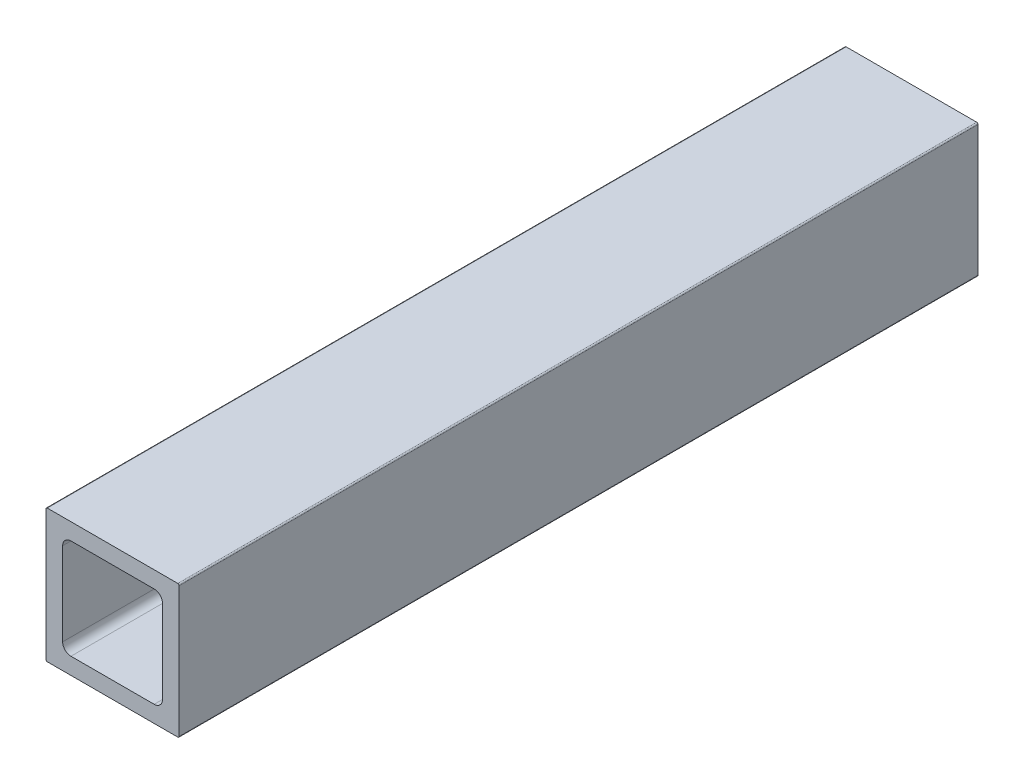
ISO-10303-21;
HEADER;
FILE_DESCRIPTION(('STEP AP214'),'2;1');
FILE_NAME('part.step','',(''),(''),'','','');
FILE_SCHEMA(('AUTOMOTIVE_DESIGN { 1 0 10303 214 1 1 1 1 }'));
ENDSEC;
DATA;
#1=APPLICATION_CONTEXT('core data for automotive mechanical design processes');
#2=APPLICATION_PROTOCOL_DEFINITION('international standard','automotive_design',2000,#1);
#3=PRODUCT_CONTEXT('',#1,'mechanical');
#4=PRODUCT('Part','Part','',(#3));
#5=PRODUCT_RELATED_PRODUCT_CATEGORY('part','',(#4));
#6=PRODUCT_DEFINITION_FORMATION('','',#4);
#7=PRODUCT_DEFINITION_CONTEXT('part definition',#1,'design');
#8=PRODUCT_DEFINITION('design','',#6,#7);
#9=PRODUCT_DEFINITION_SHAPE('','',#8);
#10=(LENGTH_UNIT() NAMED_UNIT(*) SI_UNIT(.MILLI.,.METRE.));
#11=(NAMED_UNIT(*) PLANE_ANGLE_UNIT() SI_UNIT($,.RADIAN.));
#12=(NAMED_UNIT(*) SI_UNIT($,.STERADIAN.) SOLID_ANGLE_UNIT());
#13=UNCERTAINTY_MEASURE_WITH_UNIT(LENGTH_MEASURE(1.E-05),#10,'distance_accuracy_value','');
#14=(GEOMETRIC_REPRESENTATION_CONTEXT(3) GLOBAL_UNCERTAINTY_ASSIGNED_CONTEXT((#13)) GLOBAL_UNIT_ASSIGNED_CONTEXT((#10,
#11,#12)) REPRESENTATION_CONTEXT('',''));
#15=CARTESIAN_POINT('',(0.,0.,0.));
#16=DIRECTION('',(0.,0.,1.));
#17=DIRECTION('',(1.,0.,0.));
#18=AXIS2_PLACEMENT_3D('',#15,#16,#17);
#19=CARTESIAN_POINT('',(3.175,4.7625,1828.8));
#20=DIRECTION('',(1.,0.,0.));
#21=DIRECTION('',(0.,1.,0.));
#22=AXIS2_PLACEMENT_3D('',#19,#20,#21);
#23=PLANE('',#22);
#24=DIRECTION('',(0.,-1.,0.));
#25=VECTOR('',#24,1.);
#26=CARTESIAN_POINT('',(3.175,4.7625,1676.4));
#27=LINE('',#26,#25);
#28=CARTESIAN_POINT('',(3.175,20.6375,1676.4));
#29=VERTEX_POINT('',#28);
#30=CARTESIAN_POINT('',(3.175,4.7625,1676.4));
#31=VERTEX_POINT('',#30);
#32=EDGE_CURVE('E60',#29,#31,#27,.T.);
#33=ORIENTED_EDGE('',*,*,#32,.F.);
#34=DIRECTION('',(0.,0.,-1.));
#35=VECTOR('',#34,1.);
#36=CARTESIAN_POINT('',(3.175,20.6375,1828.8));
#37=LINE('',#36,#35);
#38=CARTESIAN_POINT('',(3.175,20.6375,1828.8));
#39=VERTEX_POINT('',#38);
#40=EDGE_CURVE('E53',#39,#29,#37,.T.);
#41=ORIENTED_EDGE('',*,*,#40,.F.);
#42=DIRECTION('',(0.,-1.,0.));
#43=VECTOR('',#42,1.);
#44=CARTESIAN_POINT('',(3.175,4.7625,1828.8));
#45=LINE('',#44,#43);
#46=CARTESIAN_POINT('',(3.175,4.7625,1828.8));
#47=VERTEX_POINT('',#46);
#48=EDGE_CURVE('E219',#39,#47,#45,.T.);
#49=ORIENTED_EDGE('',*,*,#48,.T.);
#50=DIRECTION('',(0.,0.,-1.));
#51=VECTOR('',#50,1.);
#52=CARTESIAN_POINT('',(3.175,4.7625,1828.8));
#53=LINE('',#52,#51);
#54=EDGE_CURVE('E325',#47,#31,#53,.T.);
#55=ORIENTED_EDGE('',*,*,#54,.T.);
#56=EDGE_LOOP('',(#33,#41,#49,#55));
#57=FACE_BOUND('',#56,.T.);
#58=ADVANCED_FACE('F45',(#57),#23,.T.);
#59=CARTESIAN_POINT('',(4.7625,20.6375,1828.8));
#60=DIRECTION('',(0.,0.,-1.));
#61=DIRECTION('',(-1.,0.,0.));
#62=AXIS2_PLACEMENT_3D('',#59,#60,#61);
#63=CYLINDRICAL_SURFACE('',#62,1.5875);
#64=ORIENTED_EDGE('',*,*,#40,.T.);
#65=CARTESIAN_POINT('',(4.7625,20.6375,1676.4));
#66=DIRECTION('',(0.,0.,1.));
#67=DIRECTION('',(1.,0.,0.));
#68=AXIS2_PLACEMENT_3D('',#65,#66,#67);
#69=CIRCLE('',#68,1.5875);
#70=CARTESIAN_POINT('',(4.7625,22.225,1676.4));
#71=VERTEX_POINT('',#70);
#72=EDGE_CURVE('E304',#29,#71,#69,.F.);
#73=ORIENTED_EDGE('',*,*,#72,.T.);
#74=DIRECTION('',(0.,0.,-1.));
#75=VECTOR('',#74,1.);
#76=CARTESIAN_POINT('',(4.7625,22.225,1828.8));
#77=LINE('',#76,#75);
#78=CARTESIAN_POINT('',(4.7625,22.225,1828.8));
#79=VERTEX_POINT('',#78);
#80=EDGE_CURVE('E292',#79,#71,#77,.T.);
#81=ORIENTED_EDGE('',*,*,#80,.F.);
#82=CARTESIAN_POINT('',(4.7625,20.6375,1828.8));
#83=DIRECTION('',(0.,0.,1.));
#84=DIRECTION('',(-1.,0.,0.));
#85=AXIS2_PLACEMENT_3D('',#82,#83,#84);
#86=CIRCLE('',#85,1.5875);
#87=EDGE_CURVE('E224',#79,#39,#86,.T.);
#88=ORIENTED_EDGE('',*,*,#87,.T.);
#89=EDGE_LOOP('',(#64,#73,#81,#88));
#90=FACE_BOUND('',#89,.T.);
#91=ADVANCED_FACE('F302',(#90),#63,.F.);
#92=CARTESIAN_POINT('',(4.7625,22.225,1828.8));
#93=DIRECTION('',(0.,-1.,0.));
#94=DIRECTION('',(0.,0.,-1.));
#95=AXIS2_PLACEMENT_3D('',#92,#93,#94);
#96=PLANE('',#95);
#97=DIRECTION('',(-1.,0.,0.));
#98=VECTOR('',#97,1.);
#99=CARTESIAN_POINT('',(4.7625,22.225,1676.4));
#100=LINE('',#99,#98);
#101=CARTESIAN_POINT('',(20.6375,22.225,1676.4));
#102=VERTEX_POINT('',#101);
#103=EDGE_CURVE('E340',#102,#71,#100,.T.);
#104=ORIENTED_EDGE('',*,*,#103,.F.);
#105=DIRECTION('',(0.,0.,-1.));
#106=VECTOR('',#105,1.);
#107=CARTESIAN_POINT('',(20.6375,22.225,1828.8));
#108=LINE('',#107,#106);
#109=CARTESIAN_POINT('',(20.6375,22.225,1828.8));
#110=VERTEX_POINT('',#109);
#111=EDGE_CURVE('E239',#110,#102,#108,.T.);
#112=ORIENTED_EDGE('',*,*,#111,.F.);
#113=DIRECTION('',(-1.,0.,0.));
#114=VECTOR('',#113,1.);
#115=CARTESIAN_POINT('',(4.7625,22.225,1828.8));
#116=LINE('',#115,#114);
#117=EDGE_CURVE('E228',#110,#79,#116,.T.);
#118=ORIENTED_EDGE('',*,*,#117,.T.);
#119=ORIENTED_EDGE('',*,*,#80,.T.);
#120=EDGE_LOOP('',(#104,#112,#118,#119));
#121=FACE_BOUND('',#120,.T.);
#122=ADVANCED_FACE('F291',(#121),#96,.T.);
#123=CARTESIAN_POINT('',(20.6375,20.6375,1828.8));
#124=DIRECTION('',(0.,0.,-1.));
#125=DIRECTION('',(-1.,0.,0.));
#126=AXIS2_PLACEMENT_3D('',#123,#124,#125);
#127=CYLINDRICAL_SURFACE('',#126,1.5875);
#128=ORIENTED_EDGE('',*,*,#111,.T.);
#129=CARTESIAN_POINT('',(20.6375,20.6375,1676.4));
#130=DIRECTION('',(0.,0.,1.));
#131=DIRECTION('',(1.,0.,0.));
#132=AXIS2_PLACEMENT_3D('',#129,#130,#131);
#133=CIRCLE('',#132,1.5875);
#134=CARTESIAN_POINT('',(22.225,20.6375,1676.4));
#135=VERTEX_POINT('',#134);
#136=EDGE_CURVE('E342',#102,#135,#133,.F.);
#137=ORIENTED_EDGE('',*,*,#136,.T.);
#138=DIRECTION('',(0.,0.,-1.));
#139=VECTOR('',#138,1.);
#140=CARTESIAN_POINT('',(22.225,20.6375,1828.8));
#141=LINE('',#140,#139);
#142=CARTESIAN_POINT('',(22.225,20.6375,1828.8));
#143=VERTEX_POINT('',#142);
#144=EDGE_CURVE('E235',#143,#135,#141,.T.);
#145=ORIENTED_EDGE('',*,*,#144,.F.);
#146=CARTESIAN_POINT('',(20.6375,20.6375,1828.8));
#147=DIRECTION('',(0.,0.,1.));
#148=DIRECTION('',(-1.,0.,0.));
#149=AXIS2_PLACEMENT_3D('',#146,#147,#148);
#150=CIRCLE('',#149,1.5875);
#151=EDGE_CURVE('E214',#143,#110,#150,.T.);
#152=ORIENTED_EDGE('',*,*,#151,.T.);
#153=EDGE_LOOP('',(#128,#137,#145,#152));
#154=FACE_BOUND('',#153,.T.);
#155=ADVANCED_FACE('F527',(#154),#127,.F.);
#156=CARTESIAN_POINT('',(22.225,4.7625,1828.8));
#157=DIRECTION('',(-1.,0.,0.));
#158=DIRECTION('',(0.,0.,1.));
#159=AXIS2_PLACEMENT_3D('',#156,#157,#158);
#160=PLANE('',#159);
#161=DIRECTION('',(0.,1.,0.));
#162=VECTOR('',#161,1.);
#163=CARTESIAN_POINT('',(22.225,4.7625,1676.4));
#164=LINE('',#163,#162);
#165=CARTESIAN_POINT('',(22.225,4.7625,1676.4));
#166=VERTEX_POINT('',#165);
#167=EDGE_CURVE('E345',#166,#135,#164,.T.);
#168=ORIENTED_EDGE('',*,*,#167,.F.);
#169=DIRECTION('',(0.,0.,-1.));
#170=VECTOR('',#169,1.);
#171=CARTESIAN_POINT('',(22.225,4.7625,1828.8));
#172=LINE('',#171,#170);
#173=CARTESIAN_POINT('',(22.225,4.7625,1828.8));
#174=VERTEX_POINT('',#173);
#175=EDGE_CURVE('E240',#174,#166,#172,.T.);
#176=ORIENTED_EDGE('',*,*,#175,.F.);
#177=DIRECTION('',(0.,1.,0.));
#178=VECTOR('',#177,1.);
#179=CARTESIAN_POINT('',(22.225,4.7625,1828.8));
#180=LINE('',#179,#178);
#181=EDGE_CURVE('E209',#174,#143,#180,.T.);
#182=ORIENTED_EDGE('',*,*,#181,.T.);
#183=ORIENTED_EDGE('',*,*,#144,.T.);
#184=EDGE_LOOP('',(#168,#176,#182,#183));
#185=FACE_BOUND('',#184,.T.);
#186=ADVANCED_FACE('F397',(#185),#160,.T.);
#187=CARTESIAN_POINT('',(20.6375,4.7625,1828.8));
#188=DIRECTION('',(0.,0.,-1.));
#189=DIRECTION('',(-1.,0.,0.));
#190=AXIS2_PLACEMENT_3D('',#187,#188,#189);
#191=CYLINDRICAL_SURFACE('',#190,1.5875);
#192=ORIENTED_EDGE('',*,*,#175,.T.);
#193=CARTESIAN_POINT('',(20.6375,4.7625,1676.4));
#194=DIRECTION('',(0.,0.,1.));
#195=DIRECTION('',(1.,0.,0.));
#196=AXIS2_PLACEMENT_3D('',#193,#194,#195);
#197=CIRCLE('',#196,1.5875);
#198=CARTESIAN_POINT('',(20.6375,3.175,1676.4));
#199=VERTEX_POINT('',#198);
#200=EDGE_CURVE('E347',#166,#199,#197,.F.);
#201=ORIENTED_EDGE('',*,*,#200,.T.);
#202=DIRECTION('',(0.,0.,-1.));
#203=VECTOR('',#202,1.);
#204=CARTESIAN_POINT('',(20.6375,3.175,1828.8));
#205=LINE('',#204,#203);
#206=CARTESIAN_POINT('',(20.6375,3.175,1828.8));
#207=VERTEX_POINT('',#206);
#208=EDGE_CURVE('E266',#207,#199,#205,.T.);
#209=ORIENTED_EDGE('',*,*,#208,.F.);
#210=CARTESIAN_POINT('',(20.6375,4.7625,1828.8));
#211=DIRECTION('',(0.,0.,1.));
#212=DIRECTION('',(-1.,0.,0.));
#213=AXIS2_PLACEMENT_3D('',#210,#211,#212);
#214=CIRCLE('',#213,1.5875);
#215=EDGE_CURVE('E213',#207,#174,#214,.T.);
#216=ORIENTED_EDGE('',*,*,#215,.T.);
#217=EDGE_LOOP('',(#192,#201,#209,#216));
#218=FACE_BOUND('',#217,.T.);
#219=ADVANCED_FACE('F394',(#218),#191,.F.);
#220=CARTESIAN_POINT('',(4.7625,3.175,1828.8));
#221=DIRECTION('',(0.,1.,0.));
#222=DIRECTION('',(1.,0.,0.));
#223=AXIS2_PLACEMENT_3D('',#220,#221,#222);
#224=PLANE('',#223);
#225=DIRECTION('',(1.,0.,0.));
#226=VECTOR('',#225,1.);
#227=CARTESIAN_POINT('',(4.7625,3.175,1676.4));
#228=LINE('',#227,#226);
#229=CARTESIAN_POINT('',(4.7625,3.175,1676.4));
#230=VERTEX_POINT('',#229);
#231=EDGE_CURVE('E350',#230,#199,#228,.T.);
#232=ORIENTED_EDGE('',*,*,#231,.F.);
#233=DIRECTION('',(0.,0.,-1.));
#234=VECTOR('',#233,1.);
#235=CARTESIAN_POINT('',(4.7625,3.175,1828.8));
#236=LINE('',#235,#234);
#237=CARTESIAN_POINT('',(4.7625,3.175,1828.8));
#238=VERTEX_POINT('',#237);
#239=EDGE_CURVE('E270',#238,#230,#236,.T.);
#240=ORIENTED_EDGE('',*,*,#239,.F.);
#241=DIRECTION('',(1.,0.,0.));
#242=VECTOR('',#241,1.);
#243=CARTESIAN_POINT('',(4.7625,3.175,1828.8));
#244=LINE('',#243,#242);
#245=EDGE_CURVE('E256',#238,#207,#244,.T.);
#246=ORIENTED_EDGE('',*,*,#245,.T.);
#247=ORIENTED_EDGE('',*,*,#208,.T.);
#248=EDGE_LOOP('',(#232,#240,#246,#247));
#249=FACE_BOUND('',#248,.T.);
#250=ADVANCED_FACE('F396',(#249),#224,.T.);
#251=CARTESIAN_POINT('',(4.7625,4.7625,1828.8));
#252=DIRECTION('',(0.,0.,-1.));
#253=DIRECTION('',(-1.,0.,0.));
#254=AXIS2_PLACEMENT_3D('',#251,#252,#253);
#255=CYLINDRICAL_SURFACE('',#254,1.5875);
#256=ORIENTED_EDGE('',*,*,#239,.T.);
#257=CARTESIAN_POINT('',(4.7625,4.7625,1676.4));
#258=DIRECTION('',(0.,0.,1.));
#259=DIRECTION('',(1.,0.,0.));
#260=AXIS2_PLACEMENT_3D('',#257,#258,#259);
#261=CIRCLE('',#260,1.5875);
#262=EDGE_CURVE('E352',#230,#31,#261,.F.);
#263=ORIENTED_EDGE('',*,*,#262,.T.);
#264=ORIENTED_EDGE('',*,*,#54,.F.);
#265=CARTESIAN_POINT('',(4.7625,4.7625,1828.8));
#266=DIRECTION('',(0.,0.,1.));
#267=DIRECTION('',(1.,0.,0.));
#268=AXIS2_PLACEMENT_3D('',#265,#266,#267);
#269=CIRCLE('',#268,1.5875);
#270=EDGE_CURVE('E215',#47,#238,#269,.T.);
#271=ORIENTED_EDGE('',*,*,#270,.T.);
#272=EDGE_LOOP('',(#256,#263,#264,#271));
#273=FACE_BOUND('',#272,.T.);
#274=ADVANCED_FACE('F510',(#273),#255,.F.);
#275=CARTESIAN_POINT('',(0.,0.254,1828.8));
#276=DIRECTION('',(1.,0.,0.));
#277=DIRECTION('',(0.,1.,0.));
#278=AXIS2_PLACEMENT_3D('',#275,#276,#277);
#279=PLANE('',#278);
#280=DIRECTION('',(0.,0.,-1.));
#281=VECTOR('',#280,1.);
#282=CARTESIAN_POINT('',(0.,25.146,1828.8));
#283=LINE('',#282,#281);
#284=CARTESIAN_POINT('',(0.,25.146,1828.8));
#285=VERTEX_POINT('',#284);
#286=CARTESIAN_POINT('',(0.,25.146,1676.4));
#287=VERTEX_POINT('',#286);
#288=EDGE_CURVE('E265',#285,#287,#283,.T.);
#289=ORIENTED_EDGE('',*,*,#288,.T.);
#290=DIRECTION('',(0.,-1.,0.));
#291=VECTOR('',#290,1.);
#292=CARTESIAN_POINT('',(0.,0.254,1676.4));
#293=LINE('',#292,#291);
#294=CARTESIAN_POINT('',(0.,0.254,1676.4));
#295=VERTEX_POINT('',#294);
#296=EDGE_CURVE('E187',#287,#295,#293,.T.);
#297=ORIENTED_EDGE('',*,*,#296,.T.);
#298=DIRECTION('',(0.,0.,-1.));
#299=VECTOR('',#298,1.);
#300=CARTESIAN_POINT('',(0.,0.254,1828.8));
#301=LINE('',#300,#299);
#302=CARTESIAN_POINT('',(0.,0.254,1828.8));
#303=VERTEX_POINT('',#302);
#304=EDGE_CURVE('E196',#303,#295,#301,.T.);
#305=ORIENTED_EDGE('',*,*,#304,.F.);
#306=DIRECTION('',(0.,-1.,0.));
#307=VECTOR('',#306,1.);
#308=CARTESIAN_POINT('',(0.,0.254,1828.8));
#309=LINE('',#308,#307);
#310=EDGE_CURVE('E220',#285,#303,#309,.T.);
#311=ORIENTED_EDGE('',*,*,#310,.F.);
#312=EDGE_LOOP('',(#289,#297,#305,#311));
#313=FACE_BOUND('',#312,.T.);
#314=ADVANCED_FACE('F504',(#313),#279,.F.);
#315=CARTESIAN_POINT('',(0.254,25.146,1828.8));
#316=DIRECTION('',(0.,0.,-1.));
#317=DIRECTION('',(-1.,0.,0.));
#318=AXIS2_PLACEMENT_3D('',#315,#316,#317);
#319=CYLINDRICAL_SURFACE('',#318,0.254);
#320=CARTESIAN_POINT('',(0.254,25.146,1676.4));
#321=DIRECTION('',(0.,0.,1.));
#322=DIRECTION('',(1.,0.,0.));
#323=AXIS2_PLACEMENT_3D('',#320,#321,#322);
#324=CIRCLE('',#323,0.254);
#325=CARTESIAN_POINT('',(0.254000000000004,25.4,1676.4));
#326=VERTEX_POINT('',#325);
#327=EDGE_CURVE('E178',#287,#326,#324,.F.);
#328=ORIENTED_EDGE('',*,*,#327,.F.);
#329=ORIENTED_EDGE('',*,*,#288,.F.);
#330=CARTESIAN_POINT('',(0.254,25.146,1828.8));
#331=DIRECTION('',(0.,0.,1.));
#332=DIRECTION('',(-1.,0.,0.));
#333=AXIS2_PLACEMENT_3D('',#330,#331,#332);
#334=CIRCLE('',#333,0.254);
#335=CARTESIAN_POINT('',(0.254,25.4,1828.8));
#336=VERTEX_POINT('',#335);
#337=EDGE_CURVE('E241',#336,#285,#334,.T.);
#338=ORIENTED_EDGE('',*,*,#337,.F.);
#339=DIRECTION('',(0.,0.,-1.));
#340=VECTOR('',#339,1.);
#341=CARTESIAN_POINT('',(0.254,25.4,1828.8));
#342=LINE('',#341,#340);
#343=EDGE_CURVE('E261',#336,#326,#342,.T.);
#344=ORIENTED_EDGE('',*,*,#343,.T.);
#345=EDGE_LOOP('',(#328,#329,#338,#344));
#346=FACE_BOUND('',#345,.T.);
#347=ADVANCED_FACE('F509',(#346),#319,.T.);
#348=CARTESIAN_POINT('',(0.254,25.4,1828.8));
#349=DIRECTION('',(0.,-1.,0.));
#350=DIRECTION('',(0.,0.,-1.));
#351=AXIS2_PLACEMENT_3D('',#348,#349,#350);
#352=PLANE('',#351);
#353=DIRECTION('',(0.,0.,-1.));
#354=VECTOR('',#353,1.);
#355=CARTESIAN_POINT('',(25.146,25.4,1828.8));
#356=LINE('',#355,#354);
#357=CARTESIAN_POINT('',(25.146,25.4,1828.8));
#358=VERTEX_POINT('',#357);
#359=CARTESIAN_POINT('',(25.146,25.4,1676.4));
#360=VERTEX_POINT('',#359);
#361=EDGE_CURVE('E257',#358,#360,#356,.T.);
#362=ORIENTED_EDGE('',*,*,#361,.T.);
#363=DIRECTION('',(1.,0.,0.));
#364=VECTOR('',#363,1.);
#365=CARTESIAN_POINT('',(-135.222379220066,25.4,1676.4));
#366=LINE('',#365,#364);
#367=EDGE_CURVE('E188',#326,#360,#366,.T.);
#368=ORIENTED_EDGE('',*,*,#367,.F.);
#369=ORIENTED_EDGE('',*,*,#343,.F.);
#370=DIRECTION('',(-1.,0.,0.));
#371=VECTOR('',#370,1.);
#372=CARTESIAN_POINT('',(0.254,25.4,1828.8));
#373=LINE('',#372,#371);
#374=EDGE_CURVE('E233',#358,#336,#373,.T.);
#375=ORIENTED_EDGE('',*,*,#374,.F.);
#376=EDGE_LOOP('',(#362,#368,#369,#375));
#377=FACE_BOUND('',#376,.T.);
#378=ADVANCED_FACE('F367',(#377),#352,.F.);
#379=CARTESIAN_POINT('',(25.146,25.146,1828.8));
#380=DIRECTION('',(0.,0.,-1.));
#381=DIRECTION('',(-1.,0.,0.));
#382=AXIS2_PLACEMENT_3D('',#379,#380,#381);
#383=CYLINDRICAL_SURFACE('',#382,0.254);
#384=CARTESIAN_POINT('',(25.146,25.146,1676.4));
#385=DIRECTION('',(0.,0.,1.));
#386=DIRECTION('',(1.,0.,0.));
#387=AXIS2_PLACEMENT_3D('',#384,#385,#386);
#388=CIRCLE('',#387,0.254);
#389=CARTESIAN_POINT('',(25.4,25.146,1676.4));
#390=VERTEX_POINT('',#389);
#391=EDGE_CURVE('E354',#360,#390,#388,.F.);
#392=ORIENTED_EDGE('',*,*,#391,.F.);
#393=ORIENTED_EDGE('',*,*,#361,.F.);
#394=CARTESIAN_POINT('',(25.146,25.146,1828.8));
#395=DIRECTION('',(0.,0.,1.));
#396=DIRECTION('',(-1.,0.,0.));
#397=AXIS2_PLACEMENT_3D('',#394,#395,#396);
#398=CIRCLE('',#397,0.254);
#399=CARTESIAN_POINT('',(25.4,25.146,1828.8));
#400=VERTEX_POINT('',#399);
#401=EDGE_CURVE('E229',#400,#358,#398,.T.);
#402=ORIENTED_EDGE('',*,*,#401,.F.);
#403=DIRECTION('',(0.,0.,-1.));
#404=VECTOR('',#403,1.);
#405=CARTESIAN_POINT('',(25.4,25.146,1828.8));
#406=LINE('',#405,#404);
#407=EDGE_CURVE('E202',#400,#390,#406,.T.);
#408=ORIENTED_EDGE('',*,*,#407,.T.);
#409=EDGE_LOOP('',(#392,#393,#402,#408));
#410=FACE_BOUND('',#409,.T.);
#411=ADVANCED_FACE('F47',(#410),#383,.T.);
#412=CARTESIAN_POINT('',(25.4,0.254,1828.8));
#413=DIRECTION('',(-1.,0.,0.));
#414=DIRECTION('',(0.,0.,1.));
#415=AXIS2_PLACEMENT_3D('',#412,#413,#414);
#416=PLANE('',#415);
#417=DIRECTION('',(0.,0.,-1.));
#418=VECTOR('',#417,1.);
#419=CARTESIAN_POINT('',(25.4,0.254,1828.8));
#420=LINE('',#419,#418);
#421=CARTESIAN_POINT('',(25.4,0.254,1828.8));
#422=VERTEX_POINT('',#421);
#423=CARTESIAN_POINT('',(25.4,0.254,1676.4));
#424=VERTEX_POINT('',#423);
#425=EDGE_CURVE('E195',#422,#424,#420,.T.);
#426=ORIENTED_EDGE('',*,*,#425,.T.);
#427=DIRECTION('',(0.,1.,0.));
#428=VECTOR('',#427,1.);
#429=CARTESIAN_POINT('',(25.4,0.254,1676.4));
#430=LINE('',#429,#428);
#431=EDGE_CURVE('E174',#424,#390,#430,.T.);
#432=ORIENTED_EDGE('',*,*,#431,.T.);
#433=ORIENTED_EDGE('',*,*,#407,.F.);
#434=DIRECTION('',(0.,1.,0.));
#435=VECTOR('',#434,1.);
#436=CARTESIAN_POINT('',(25.4,0.254,1828.8));
#437=LINE('',#436,#435);
#438=EDGE_CURVE('E234',#422,#400,#437,.T.);
#439=ORIENTED_EDGE('',*,*,#438,.F.);
#440=EDGE_LOOP('',(#426,#432,#433,#439));
#441=FACE_BOUND('',#440,.T.);
#442=ADVANCED_FACE('F371',(#441),#416,.F.);
#443=CARTESIAN_POINT('',(25.146,0.254,1828.8));
#444=DIRECTION('',(0.,0.,-1.));
#445=DIRECTION('',(-1.,0.,0.));
#446=AXIS2_PLACEMENT_3D('',#443,#444,#445);
#447=CYLINDRICAL_SURFACE('',#446,0.254);
#448=CARTESIAN_POINT('',(25.146,0.254,1676.4));
#449=DIRECTION('',(0.,0.,1.));
#450=DIRECTION('',(1.,0.,0.));
#451=AXIS2_PLACEMENT_3D('',#448,#449,#450);
#452=CIRCLE('',#451,0.254);
#453=CARTESIAN_POINT('',(25.146,0.,1676.4));
#454=VERTEX_POINT('',#453);
#455=EDGE_CURVE('E171',#424,#454,#452,.F.);
#456=ORIENTED_EDGE('',*,*,#455,.F.);
#457=ORIENTED_EDGE('',*,*,#425,.F.);
#458=CARTESIAN_POINT('',(25.146,0.254,1828.8));
#459=DIRECTION('',(0.,0.,1.));
#460=DIRECTION('',(1.,0.,0.));
#461=AXIS2_PLACEMENT_3D('',#458,#459,#460);
#462=CIRCLE('',#461,0.254);
#463=CARTESIAN_POINT('',(25.146,0.,1828.8));
#464=VERTEX_POINT('',#463);
#465=EDGE_CURVE('E192',#464,#422,#462,.T.);
#466=ORIENTED_EDGE('',*,*,#465,.F.);
#467=DIRECTION('',(0.,0.,-1.));
#468=VECTOR('',#467,1.);
#469=CARTESIAN_POINT('',(25.146,0.,1828.8));
#470=LINE('',#469,#468);
#471=EDGE_CURVE('E184',#464,#454,#470,.T.);
#472=ORIENTED_EDGE('',*,*,#471,.T.);
#473=EDGE_LOOP('',(#456,#457,#466,#472));
#474=FACE_BOUND('',#473,.T.);
#475=ADVANCED_FACE('F190',(#474),#447,.T.);
#476=CARTESIAN_POINT('',(0.254,0.,1828.8));
#477=DIRECTION('',(0.,1.,0.));
#478=DIRECTION('',(1.,0.,0.));
#479=AXIS2_PLACEMENT_3D('',#476,#477,#478);
#480=PLANE('',#479);
#481=DIRECTION('',(0.,0.,-1.));
#482=VECTOR('',#481,1.);
#483=CARTESIAN_POINT('',(0.254,0.,1828.8));
#484=LINE('',#483,#482);
#485=CARTESIAN_POINT('',(0.254,0.,1828.8));
#486=VERTEX_POINT('',#485);
#487=CARTESIAN_POINT('',(0.254,0.,1676.4));
#488=VERTEX_POINT('',#487);
#489=EDGE_CURVE('E186',#486,#488,#484,.T.);
#490=ORIENTED_EDGE('',*,*,#489,.T.);
#491=DIRECTION('',(-1.,0.,0.));
#492=VECTOR('',#491,1.);
#493=CARTESIAN_POINT('',(-135.222379220066,0.,1676.4));
#494=LINE('',#493,#492);
#495=EDGE_CURVE('E67',#454,#488,#494,.T.);
#496=ORIENTED_EDGE('',*,*,#495,.F.);
#497=ORIENTED_EDGE('',*,*,#471,.F.);
#498=DIRECTION('',(1.,0.,0.));
#499=VECTOR('',#498,1.);
#500=CARTESIAN_POINT('',(0.254,0.,1828.8));
#501=LINE('',#500,#499);
#502=EDGE_CURVE('E250',#486,#464,#501,.T.);
#503=ORIENTED_EDGE('',*,*,#502,.F.);
#504=EDGE_LOOP('',(#490,#496,#497,#503));
#505=FACE_BOUND('',#504,.T.);
#506=ADVANCED_FACE('F182',(#505),#480,.F.);
#507=CARTESIAN_POINT('',(0.254,0.254,1828.8));
#508=DIRECTION('',(0.,0.,-1.));
#509=DIRECTION('',(-1.,0.,0.));
#510=AXIS2_PLACEMENT_3D('',#507,#508,#509);
#511=CYLINDRICAL_SURFACE('',#510,0.254);
#512=CARTESIAN_POINT('',(0.254,0.254,1676.4));
#513=DIRECTION('',(0.,0.,1.));
#514=DIRECTION('',(1.,0.,0.));
#515=AXIS2_PLACEMENT_3D('',#512,#513,#514);
#516=CIRCLE('',#515,0.254);
#517=EDGE_CURVE('E11',#488,#295,#516,.F.);
#518=ORIENTED_EDGE('',*,*,#517,.F.);
#519=ORIENTED_EDGE('',*,*,#489,.F.);
#520=CARTESIAN_POINT('',(0.254,0.254,1828.8));
#521=DIRECTION('',(0.,0.,1.));
#522=DIRECTION('',(-1.,0.,0.));
#523=AXIS2_PLACEMENT_3D('',#520,#521,#522);
#524=CIRCLE('',#523,0.254);
#525=EDGE_CURVE('E253',#303,#486,#524,.T.);
#526=ORIENTED_EDGE('',*,*,#525,.F.);
#527=ORIENTED_EDGE('',*,*,#304,.T.);
#528=EDGE_LOOP('',(#518,#519,#526,#527));
#529=FACE_BOUND('',#528,.T.);
#530=ADVANCED_FACE('F390',(#529),#511,.T.);
#531=CARTESIAN_POINT('',(0.254,0.254,1828.8));
#532=DIRECTION('',(0.,0.,-1.));
#533=DIRECTION('',(0.,-1.,0.));
#534=AXIS2_PLACEMENT_3D('',#531,#532,#533);
#535=PLANE('',#534);
#536=ORIENTED_EDGE('',*,*,#270,.F.);
#537=ORIENTED_EDGE('',*,*,#48,.F.);
#538=ORIENTED_EDGE('',*,*,#87,.F.);
#539=ORIENTED_EDGE('',*,*,#117,.F.);
#540=ORIENTED_EDGE('',*,*,#151,.F.);
#541=ORIENTED_EDGE('',*,*,#181,.F.);
#542=ORIENTED_EDGE('',*,*,#215,.F.);
#543=ORIENTED_EDGE('',*,*,#245,.F.);
#544=EDGE_LOOP('',(#536,#537,#538,#539,#540,#541,#542,#543));
#545=FACE_BOUND('',#544,.T.);
#546=ORIENTED_EDGE('',*,*,#525,.T.);
#547=ORIENTED_EDGE('',*,*,#502,.T.);
#548=ORIENTED_EDGE('',*,*,#465,.T.);
#549=ORIENTED_EDGE('',*,*,#438,.T.);
#550=ORIENTED_EDGE('',*,*,#401,.T.);
#551=ORIENTED_EDGE('',*,*,#374,.T.);
#552=ORIENTED_EDGE('',*,*,#337,.T.);
#553=ORIENTED_EDGE('',*,*,#310,.T.);
#554=EDGE_LOOP('',(#546,#547,#548,#549,#550,#551,#552,#553));
#555=FACE_BOUND('',#554,.T.);
#556=ADVANCED_FACE('F298',(#545,#555),#535,.F.);
#557=CARTESIAN_POINT('',(-135.222379220066,-1698.05805618886,1676.4));
#558=DIRECTION('',(0.,0.,1.));
#559=DIRECTION('',(1.,0.,0.));
#560=AXIS2_PLACEMENT_3D('',#557,#558,#559);
#561=PLANE('',#560);
#562=ORIENTED_EDGE('',*,*,#32,.T.);
#563=ORIENTED_EDGE('',*,*,#262,.F.);
#564=ORIENTED_EDGE('',*,*,#231,.T.);
#565=ORIENTED_EDGE('',*,*,#200,.F.);
#566=ORIENTED_EDGE('',*,*,#167,.T.);
#567=ORIENTED_EDGE('',*,*,#136,.F.);
#568=ORIENTED_EDGE('',*,*,#103,.T.);
#569=ORIENTED_EDGE('',*,*,#72,.F.);
#570=EDGE_LOOP('',(#562,#563,#564,#565,#566,#567,#568,#569));
#571=FACE_BOUND('',#570,.T.);
#572=ORIENTED_EDGE('',*,*,#391,.T.);
#573=ORIENTED_EDGE('',*,*,#431,.F.);
#574=ORIENTED_EDGE('',*,*,#455,.T.);
#575=ORIENTED_EDGE('',*,*,#495,.T.);
#576=ORIENTED_EDGE('',*,*,#517,.T.);
#577=ORIENTED_EDGE('',*,*,#296,.F.);
#578=ORIENTED_EDGE('',*,*,#327,.T.);
#579=ORIENTED_EDGE('',*,*,#367,.T.);
#580=EDGE_LOOP('',(#572,#573,#574,#575,#576,#577,#578,#579));
#581=FACE_BOUND('',#580,.T.);
#582=ADVANCED_FACE('F172',(#571,#581),#561,.F.);
#583=CLOSED_SHELL('',(#58,#91,#122,#155,#186,#219,#250,#274,#314,#347,#378,#411,#442,#475,#506,
#530,#556,#582));
#584=MANIFOLD_SOLID_BREP('B2',#583);
#585=ADVANCED_BREP_SHAPE_REPRESENTATION('',(#18,#584),#14);
#586=SHAPE_DEFINITION_REPRESENTATION(#9,#585);
ENDSEC;
END-ISO-10303-21;
